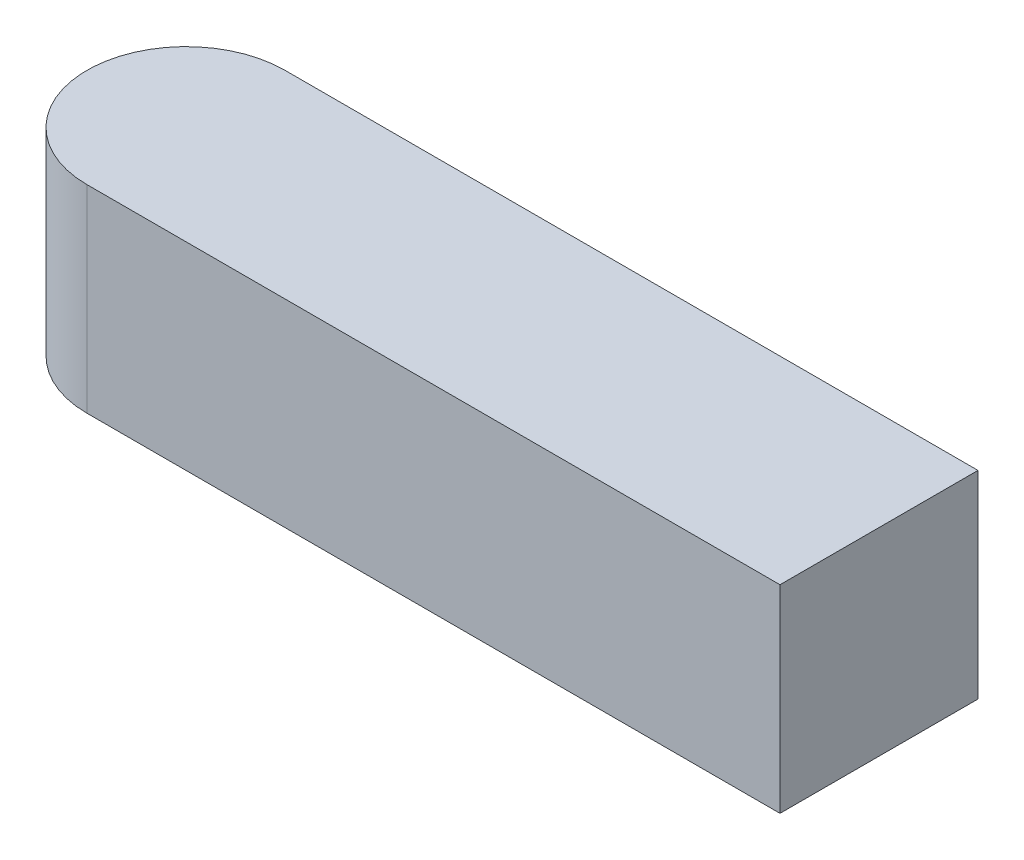
ISO-10303-21;
HEADER;
FILE_DESCRIPTION(('STEP AP214'),'2;1');
FILE_NAME('part.step','',(''),(''),'','','');
FILE_SCHEMA(('AUTOMOTIVE_DESIGN { 1 0 10303 214 1 1 1 1 }'));
ENDSEC;
DATA;
#1=APPLICATION_CONTEXT('core data for automotive mechanical design processes');
#2=APPLICATION_PROTOCOL_DEFINITION('international standard','automotive_design',2000,#1);
#3=PRODUCT_CONTEXT('',#1,'mechanical');
#4=PRODUCT('Part','Part','',(#3));
#5=PRODUCT_RELATED_PRODUCT_CATEGORY('part','',(#4));
#6=PRODUCT_DEFINITION_FORMATION('','',#4);
#7=PRODUCT_DEFINITION_CONTEXT('part definition',#1,'design');
#8=PRODUCT_DEFINITION('design','',#6,#7);
#9=PRODUCT_DEFINITION_SHAPE('','',#8);
#10=(LENGTH_UNIT() NAMED_UNIT(*) SI_UNIT(.MILLI.,.METRE.));
#11=(NAMED_UNIT(*) PLANE_ANGLE_UNIT() SI_UNIT($,.RADIAN.));
#12=(NAMED_UNIT(*) SI_UNIT($,.STERADIAN.) SOLID_ANGLE_UNIT());
#13=UNCERTAINTY_MEASURE_WITH_UNIT(LENGTH_MEASURE(1.E-05),#10,'distance_accuracy_value','');
#14=(GEOMETRIC_REPRESENTATION_CONTEXT(3) GLOBAL_UNCERTAINTY_ASSIGNED_CONTEXT((#13)) GLOBAL_UNIT_ASSIGNED_CONTEXT((#10,
#11,#12)) REPRESENTATION_CONTEXT('',''));
#15=CARTESIAN_POINT('',(0.,0.,0.));
#16=DIRECTION('',(0.,0.,1.));
#17=DIRECTION('',(1.,0.,0.));
#18=AXIS2_PLACEMENT_3D('',#15,#16,#17);
#19=CARTESIAN_POINT('',(-70.,20.,0.));
#20=DIRECTION('',(0.,-1.,0.));
#21=DIRECTION('',(0.,0.,-1.));
#22=AXIS2_PLACEMENT_3D('',#19,#20,#21);
#23=CYLINDRICAL_SURFACE('',#22,10.);
#24=CARTESIAN_POINT('',(-70.,0.,0.));
#25=DIRECTION('',(0.,1.,0.));
#26=DIRECTION('',(0.,0.,1.));
#27=AXIS2_PLACEMENT_3D('',#24,#25,#26);
#28=CIRCLE('',#27,10.);
#29=CARTESIAN_POINT('',(-70.,0.,-10.));
#30=VERTEX_POINT('',#29);
#31=CARTESIAN_POINT('',(-70.,0.,10.));
#32=VERTEX_POINT('',#31);
#33=EDGE_CURVE('E84',#30,#32,#28,.T.);
#34=ORIENTED_EDGE('',*,*,#33,.T.);
#35=DIRECTION('',(0.,-1.,0.));
#36=VECTOR('',#35,1.);
#37=CARTESIAN_POINT('',(-70.,20.,10.));
#38=LINE('',#37,#36);
#39=CARTESIAN_POINT('',(-70.,20.,10.));
#40=VERTEX_POINT('',#39);
#41=EDGE_CURVE('E11',#40,#32,#38,.T.);
#42=ORIENTED_EDGE('',*,*,#41,.F.);
#43=CARTESIAN_POINT('',(-70.,20.,0.));
#44=DIRECTION('',(0.,1.,0.));
#45=DIRECTION('',(0.,0.,1.));
#46=AXIS2_PLACEMENT_3D('',#43,#44,#45);
#47=CIRCLE('',#46,10.);
#48=CARTESIAN_POINT('',(-70.,20.,-10.));
#49=VERTEX_POINT('',#48);
#50=EDGE_CURVE('E78',#49,#40,#47,.T.);
#51=ORIENTED_EDGE('',*,*,#50,.F.);
#52=DIRECTION('',(0.,-1.,0.));
#53=VECTOR('',#52,1.);
#54=CARTESIAN_POINT('',(-70.,20.,-10.));
#55=LINE('',#54,#53);
#56=EDGE_CURVE('E40',#49,#30,#55,.T.);
#57=ORIENTED_EDGE('',*,*,#56,.T.);
#58=EDGE_LOOP('',(#34,#42,#51,#57));
#59=FACE_BOUND('',#58,.T.);
#60=ADVANCED_FACE('F33',(#59),#23,.T.);
#61=CARTESIAN_POINT('',(-70.,20.,10.));
#62=DIRECTION('',(0.,0.,-1.));
#63=DIRECTION('',(-1.,0.,0.));
#64=AXIS2_PLACEMENT_3D('',#61,#62,#63);
#65=PLANE('',#64);
#66=DIRECTION('',(1.,0.,0.));
#67=VECTOR('',#66,1.);
#68=CARTESIAN_POINT('',(-70.,0.,10.));
#69=LINE('',#68,#67);
#70=CARTESIAN_POINT('',(0.,0.,10.));
#71=VERTEX_POINT('',#70);
#72=EDGE_CURVE('E79',#32,#71,#69,.T.);
#73=ORIENTED_EDGE('',*,*,#72,.T.);
#74=DIRECTION('',(0.,1.,0.));
#75=VECTOR('',#74,1.);
#76=CARTESIAN_POINT('',(0.,0.,10.));
#77=LINE('',#76,#75);
#78=CARTESIAN_POINT('',(0.,20.,10.));
#79=VERTEX_POINT('',#78);
#80=EDGE_CURVE('E47',#71,#79,#77,.T.);
#81=ORIENTED_EDGE('',*,*,#80,.T.);
#82=DIRECTION('',(1.,0.,0.));
#83=VECTOR('',#82,1.);
#84=CARTESIAN_POINT('',(-70.,20.,10.));
#85=LINE('',#84,#83);
#86=EDGE_CURVE('E92',#40,#79,#85,.T.);
#87=ORIENTED_EDGE('',*,*,#86,.F.);
#88=ORIENTED_EDGE('',*,*,#41,.T.);
#89=EDGE_LOOP('',(#73,#81,#87,#88));
#90=FACE_BOUND('',#89,.T.);
#91=ADVANCED_FACE('F101',(#90),#65,.F.);
#92=CARTESIAN_POINT('',(-70.,20.,-10.));
#93=DIRECTION('',(0.,0.,1.));
#94=DIRECTION('',(1.,0.,0.));
#95=AXIS2_PLACEMENT_3D('',#92,#93,#94);
#96=PLANE('',#95);
#97=DIRECTION('',(-1.,0.,0.));
#98=VECTOR('',#97,1.);
#99=CARTESIAN_POINT('',(-70.,20.,-10.));
#100=LINE('',#99,#98);
#101=CARTESIAN_POINT('',(0.,20.,-10.));
#102=VERTEX_POINT('',#101);
#103=EDGE_CURVE('E56',#102,#49,#100,.T.);
#104=ORIENTED_EDGE('',*,*,#103,.F.);
#105=DIRECTION('',(0.,1.,0.));
#106=VECTOR('',#105,1.);
#107=CARTESIAN_POINT('',(0.,0.,-10.));
#108=LINE('',#107,#106);
#109=CARTESIAN_POINT('',(0.,0.,-10.));
#110=VERTEX_POINT('',#109);
#111=EDGE_CURVE('E75',#110,#102,#108,.T.);
#112=ORIENTED_EDGE('',*,*,#111,.F.);
#113=DIRECTION('',(-1.,0.,0.));
#114=VECTOR('',#113,1.);
#115=CARTESIAN_POINT('',(-70.,0.,-10.));
#116=LINE('',#115,#114);
#117=EDGE_CURVE('E70',#110,#30,#116,.T.);
#118=ORIENTED_EDGE('',*,*,#117,.T.);
#119=ORIENTED_EDGE('',*,*,#56,.F.);
#120=EDGE_LOOP('',(#104,#112,#118,#119));
#121=FACE_BOUND('',#120,.T.);
#122=ADVANCED_FACE('F72',(#121),#96,.F.);
#123=CARTESIAN_POINT('',(-70.,20.,0.));
#124=DIRECTION('',(0.,1.,0.));
#125=DIRECTION('',(0.,0.,1.));
#126=AXIS2_PLACEMENT_3D('',#123,#124,#125);
#127=PLANE('',#126);
#128=DIRECTION('',(0.,0.,1.));
#129=VECTOR('',#128,1.);
#130=CARTESIAN_POINT('',(0.,20.,-10.));
#131=LINE('',#130,#129);
#132=EDGE_CURVE('E98',#102,#79,#131,.T.);
#133=ORIENTED_EDGE('',*,*,#132,.F.);
#134=ORIENTED_EDGE('',*,*,#103,.T.);
#135=ORIENTED_EDGE('',*,*,#50,.T.);
#136=ORIENTED_EDGE('',*,*,#86,.T.);
#137=EDGE_LOOP('',(#133,#134,#135,#136));
#138=FACE_BOUND('',#137,.T.);
#139=ADVANCED_FACE('F103',(#138),#127,.T.);
#140=CARTESIAN_POINT('',(-70.,0.,0.));
#141=DIRECTION('',(0.,1.,0.));
#142=DIRECTION('',(0.,0.,1.));
#143=AXIS2_PLACEMENT_3D('',#140,#141,#142);
#144=PLANE('',#143);
#145=ORIENTED_EDGE('',*,*,#117,.F.);
#146=DIRECTION('',(0.,0.,1.));
#147=VECTOR('',#146,1.);
#148=CARTESIAN_POINT('',(0.,0.,-10.));
#149=LINE('',#148,#147);
#150=EDGE_CURVE('E96',#110,#71,#149,.T.);
#151=ORIENTED_EDGE('',*,*,#150,.T.);
#152=ORIENTED_EDGE('',*,*,#72,.F.);
#153=ORIENTED_EDGE('',*,*,#33,.F.);
#154=EDGE_LOOP('',(#145,#151,#152,#153));
#155=FACE_BOUND('',#154,.T.);
#156=ADVANCED_FACE('F85',(#155),#144,.F.);
#157=CARTESIAN_POINT('',(0.,0.,-10.));
#158=DIRECTION('',(-1.,0.,0.));
#159=DIRECTION('',(0.,0.,1.));
#160=AXIS2_PLACEMENT_3D('',#157,#158,#159);
#161=PLANE('',#160);
#162=ORIENTED_EDGE('',*,*,#132,.T.);
#163=ORIENTED_EDGE('',*,*,#80,.F.);
#164=ORIENTED_EDGE('',*,*,#150,.F.);
#165=ORIENTED_EDGE('',*,*,#111,.T.);
#166=EDGE_LOOP('',(#162,#163,#164,#165));
#167=FACE_BOUND('',#166,.T.);
#168=ADVANCED_FACE('F111',(#167),#161,.F.);
#169=CLOSED_SHELL('',(#60,#91,#122,#139,#156,#168));
#170=MANIFOLD_SOLID_BREP('B2',#169);
#171=ADVANCED_BREP_SHAPE_REPRESENTATION('',(#18,#170),#14);
#172=SHAPE_DEFINITION_REPRESENTATION(#9,#171);
ENDSEC;
END-ISO-10303-21;
